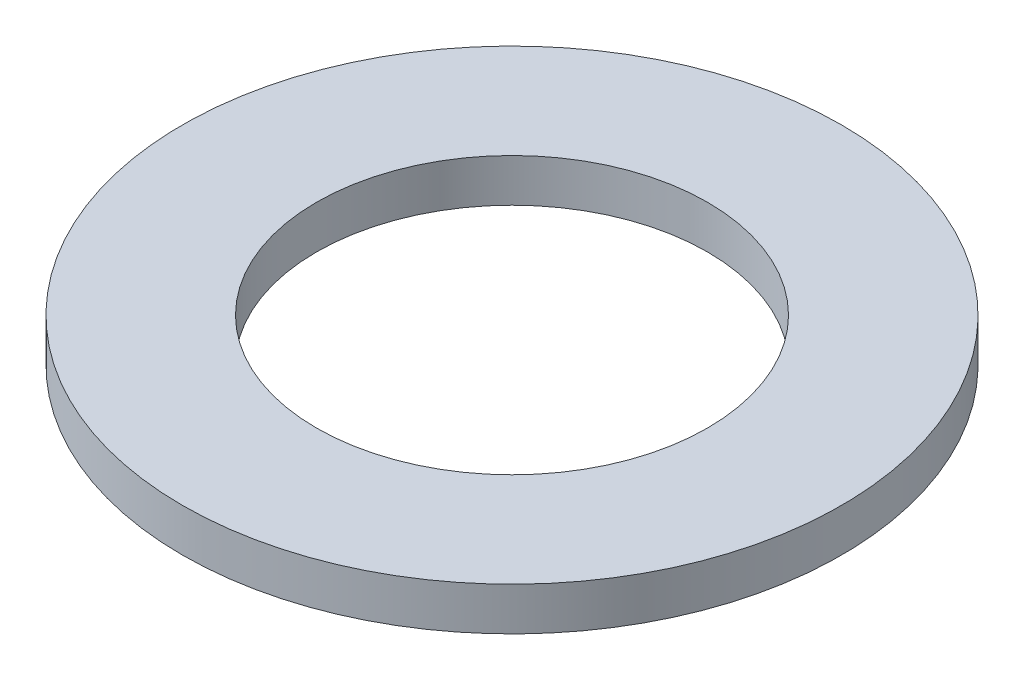
ISO-10303-21;
HEADER;
FILE_DESCRIPTION(('STEP AP214'),'2;1');
FILE_NAME('part.step','',(''),(''),'','','');
FILE_SCHEMA(('AUTOMOTIVE_DESIGN { 1 0 10303 214 1 1 1 1 }'));
ENDSEC;
DATA;
#1=APPLICATION_CONTEXT('core data for automotive mechanical design processes');
#2=APPLICATION_PROTOCOL_DEFINITION('international standard','automotive_design',2000,#1);
#3=PRODUCT_CONTEXT('',#1,'mechanical');
#4=PRODUCT('Part','Part','',(#3));
#5=PRODUCT_RELATED_PRODUCT_CATEGORY('part','',(#4));
#6=PRODUCT_DEFINITION_FORMATION('','',#4);
#7=PRODUCT_DEFINITION_CONTEXT('part definition',#1,'design');
#8=PRODUCT_DEFINITION('design','',#6,#7);
#9=PRODUCT_DEFINITION_SHAPE('','',#8);
#10=(LENGTH_UNIT() NAMED_UNIT(*) SI_UNIT(.MILLI.,.METRE.));
#11=(NAMED_UNIT(*) PLANE_ANGLE_UNIT() SI_UNIT($,.RADIAN.));
#12=(NAMED_UNIT(*) SI_UNIT($,.STERADIAN.) SOLID_ANGLE_UNIT());
#13=UNCERTAINTY_MEASURE_WITH_UNIT(LENGTH_MEASURE(1.E-05),#10,'distance_accuracy_value','');
#14=(GEOMETRIC_REPRESENTATION_CONTEXT(3) GLOBAL_UNCERTAINTY_ASSIGNED_CONTEXT((#13)) GLOBAL_UNIT_ASSIGNED_CONTEXT((#10,
#11,#12)) REPRESENTATION_CONTEXT('',''));
#15=CARTESIAN_POINT('',(0.,0.,0.));
#16=DIRECTION('',(0.,0.,1.));
#17=DIRECTION('',(1.,0.,0.));
#18=AXIS2_PLACEMENT_3D('',#15,#16,#17);
#19=CARTESIAN_POINT('',(0.,2.4892,0.));
#20=DIRECTION('',(0.,-1.,0.));
#21=DIRECTION('',(0.,0.,-1.));
#22=AXIS2_PLACEMENT_3D('',#19,#20,#21);
#23=CYLINDRICAL_SURFACE('',#22,19.05);
#24=CARTESIAN_POINT('',(0.,2.4892,0.));
#25=DIRECTION('',(0.,1.,0.));
#26=DIRECTION('',(0.,0.,1.));
#27=AXIS2_PLACEMENT_3D('',#24,#25,#26);
#28=CIRCLE('',#27,19.05);
#29=CARTESIAN_POINT('',(0.,2.4892,19.05));
#30=VERTEX_POINT('',#29);
#31=EDGE_CURVE('E10',#30,#30,#28,.T.);
#32=ORIENTED_EDGE('',*,*,#31,.F.);
#33=EDGE_LOOP('',(#32));
#34=FACE_BOUND('',#33,.T.);
#35=CARTESIAN_POINT('',(0.,0.,0.));
#36=DIRECTION('',(0.,1.,0.));
#37=DIRECTION('',(0.,0.,1.));
#38=AXIS2_PLACEMENT_3D('',#35,#36,#37);
#39=CIRCLE('',#38,19.05);
#40=CARTESIAN_POINT('',(0.,0.,19.05));
#41=VERTEX_POINT('',#40);
#42=EDGE_CURVE('E37',#41,#41,#39,.T.);
#43=ORIENTED_EDGE('',*,*,#42,.T.);
#44=EDGE_LOOP('',(#43));
#45=FACE_BOUND('',#44,.T.);
#46=ADVANCED_FACE('F34',(#34,#45),#23,.T.);
#47=CARTESIAN_POINT('',(0.,2.4892,0.));
#48=DIRECTION('',(0.,1.,0.));
#49=DIRECTION('',(0.,0.,1.));
#50=AXIS2_PLACEMENT_3D('',#47,#48,#49);
#51=PLANE('',#50);
#52=CARTESIAN_POINT('',(0.,2.4892,0.));
#53=DIRECTION('',(0.,1.,0.));
#54=DIRECTION('',(0.,0.,1.));
#55=AXIS2_PLACEMENT_3D('',#52,#53,#54);
#56=CIRCLE('',#55,11.303);
#57=CARTESIAN_POINT('',(0.,2.4892,11.303));
#58=VERTEX_POINT('',#57);
#59=EDGE_CURVE('E48',#58,#58,#56,.T.);
#60=ORIENTED_EDGE('',*,*,#59,.F.);
#61=EDGE_LOOP('',(#60));
#62=FACE_BOUND('',#61,.T.);
#63=ORIENTED_EDGE('',*,*,#31,.T.);
#64=EDGE_LOOP('',(#63));
#65=FACE_BOUND('',#64,.T.);
#66=ADVANCED_FACE('F65',(#62,#65),#51,.T.);
#67=CARTESIAN_POINT('',(0.,0.,0.));
#68=DIRECTION('',(0.,1.,0.));
#69=DIRECTION('',(0.,0.,1.));
#70=AXIS2_PLACEMENT_3D('',#67,#68,#69);
#71=PLANE('',#70);
#72=CARTESIAN_POINT('',(0.,0.,0.));
#73=DIRECTION('',(0.,1.,0.));
#74=DIRECTION('',(0.,0.,1.));
#75=AXIS2_PLACEMENT_3D('',#72,#73,#74);
#76=CIRCLE('',#75,11.303);
#77=CARTESIAN_POINT('',(0.,0.,11.303));
#78=VERTEX_POINT('',#77);
#79=EDGE_CURVE('E46',#78,#78,#76,.T.);
#80=ORIENTED_EDGE('',*,*,#79,.T.);
#81=EDGE_LOOP('',(#80));
#82=FACE_BOUND('',#81,.T.);
#83=ORIENTED_EDGE('',*,*,#42,.F.);
#84=EDGE_LOOP('',(#83));
#85=FACE_BOUND('',#84,.T.);
#86=ADVANCED_FACE('F56',(#82,#85),#71,.F.);
#87=CARTESIAN_POINT('',(0.,0.,0.));
#88=DIRECTION('',(0.,1.,0.));
#89=DIRECTION('',(0.,0.,1.));
#90=AXIS2_PLACEMENT_3D('',#87,#88,#89);
#91=CYLINDRICAL_SURFACE('',#90,11.303);
#92=ORIENTED_EDGE('',*,*,#79,.F.);
#93=EDGE_LOOP('',(#92));
#94=FACE_BOUND('',#93,.T.);
#95=ORIENTED_EDGE('',*,*,#59,.T.);
#96=EDGE_LOOP('',(#95));
#97=FACE_BOUND('',#96,.T.);
#98=ADVANCED_FACE('F59',(#94,#97),#91,.F.);
#99=CLOSED_SHELL('',(#46,#66,#86,#98));
#100=MANIFOLD_SOLID_BREP('B2',#99);
#101=ADVANCED_BREP_SHAPE_REPRESENTATION('',(#18,#100),#14);
#102=SHAPE_DEFINITION_REPRESENTATION(#9,#101);
ENDSEC;
END-ISO-10303-21;
